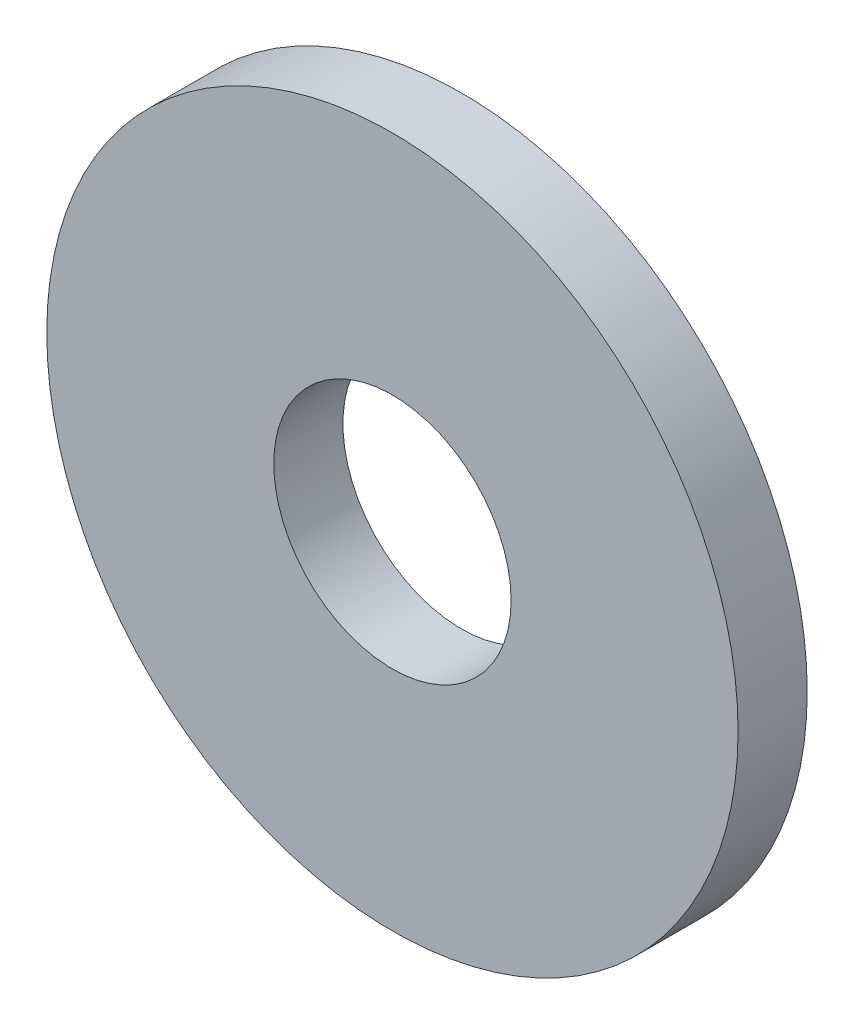
ISO-10303-21;
HEADER;
FILE_DESCRIPTION(('STEP AP214'),'2;1');
FILE_NAME('part.step','',(''),(''),'','','');
FILE_SCHEMA(('AUTOMOTIVE_DESIGN { 1 0 10303 214 1 1 1 1 }'));
ENDSEC;
DATA;
#1=APPLICATION_CONTEXT('core data for automotive mechanical design processes');
#2=APPLICATION_PROTOCOL_DEFINITION('international standard','automotive_design',2000,#1);
#3=PRODUCT_CONTEXT('',#1,'mechanical');
#4=PRODUCT('Part','Part','',(#3));
#5=PRODUCT_RELATED_PRODUCT_CATEGORY('part','',(#4));
#6=PRODUCT_DEFINITION_FORMATION('','',#4);
#7=PRODUCT_DEFINITION_CONTEXT('part definition',#1,'design');
#8=PRODUCT_DEFINITION('design','',#6,#7);
#9=PRODUCT_DEFINITION_SHAPE('','',#8);
#10=(LENGTH_UNIT() NAMED_UNIT(*) SI_UNIT(.MILLI.,.METRE.));
#11=(NAMED_UNIT(*) PLANE_ANGLE_UNIT() SI_UNIT($,.RADIAN.));
#12=(NAMED_UNIT(*) SI_UNIT($,.STERADIAN.) SOLID_ANGLE_UNIT());
#13=UNCERTAINTY_MEASURE_WITH_UNIT(LENGTH_MEASURE(1.E-05),#10,'distance_accuracy_value','');
#14=(GEOMETRIC_REPRESENTATION_CONTEXT(3) GLOBAL_UNCERTAINTY_ASSIGNED_CONTEXT((#13)) GLOBAL_UNIT_ASSIGNED_CONTEXT((#10,
#11,#12)) REPRESENTATION_CONTEXT('',''));
#15=CARTESIAN_POINT('',(0.,0.,0.));
#16=DIRECTION('',(0.,0.,1.));
#17=DIRECTION('',(1.,0.,0.));
#18=AXIS2_PLACEMENT_3D('',#15,#16,#17);
#19=CARTESIAN_POINT('',(0.,0.,1.5));
#20=DIRECTION('',(0.,0.,1.));
#21=DIRECTION('',(1.,0.,0.));
#22=AXIS2_PLACEMENT_3D('',#19,#20,#21);
#23=PLANE('',#22);
#24=CARTESIAN_POINT('',(0.,0.,1.5));
#25=DIRECTION('',(0.,0.,1.));
#26=DIRECTION('',(1.,0.,0.));
#27=AXIS2_PLACEMENT_3D('',#24,#25,#26);
#28=CIRCLE('',#27,7.5);
#29=CARTESIAN_POINT('',(7.5,0.,1.5));
#30=VERTEX_POINT('',#29);
#31=EDGE_CURVE('E9',#30,#30,#28,.T.);
#32=ORIENTED_EDGE('',*,*,#31,.T.);
#33=EDGE_LOOP('',(#32));
#34=FACE_BOUND('',#33,.T.);
#35=CARTESIAN_POINT('',(0.,0.,1.5));
#36=DIRECTION('',(0.,0.,1.));
#37=DIRECTION('',(1.,0.,0.));
#38=AXIS2_PLACEMENT_3D('',#35,#36,#37);
#39=CIRCLE('',#38,2.575);
#40=CARTESIAN_POINT('',(2.575,0.,1.5));
#41=VERTEX_POINT('',#40);
#42=EDGE_CURVE('E25',#41,#41,#39,.T.);
#43=ORIENTED_EDGE('',*,*,#42,.F.);
#44=EDGE_LOOP('',(#43));
#45=FACE_BOUND('',#44,.T.);
#46=ADVANCED_FACE('F14',(#34,#45),#23,.T.);
#47=CARTESIAN_POINT('',(0.,0.,0.));
#48=DIRECTION('',(0.,0.,1.));
#49=DIRECTION('',(1.,0.,0.));
#50=AXIS2_PLACEMENT_3D('',#47,#48,#49);
#51=PLANE('',#50);
#52=CARTESIAN_POINT('',(0.,0.,0.));
#53=DIRECTION('',(0.,0.,1.));
#54=DIRECTION('',(1.,0.,0.));
#55=AXIS2_PLACEMENT_3D('',#52,#53,#54);
#56=CIRCLE('',#55,7.5);
#57=CARTESIAN_POINT('',(7.5,0.,0.));
#58=VERTEX_POINT('',#57);
#59=EDGE_CURVE('E18',#58,#58,#56,.T.);
#60=ORIENTED_EDGE('',*,*,#59,.F.);
#61=EDGE_LOOP('',(#60));
#62=FACE_BOUND('',#61,.T.);
#63=CARTESIAN_POINT('',(0.,0.,0.));
#64=DIRECTION('',(0.,0.,1.));
#65=DIRECTION('',(1.,0.,0.));
#66=AXIS2_PLACEMENT_3D('',#63,#64,#65);
#67=CIRCLE('',#66,2.575);
#68=CARTESIAN_POINT('',(2.575,0.,0.));
#69=VERTEX_POINT('',#68);
#70=EDGE_CURVE('E27',#69,#69,#67,.T.);
#71=ORIENTED_EDGE('',*,*,#70,.T.);
#72=EDGE_LOOP('',(#71));
#73=FACE_BOUND('',#72,.T.);
#74=ADVANCED_FACE('F37',(#62,#73),#51,.F.);
#75=CARTESIAN_POINT('',(0.,0.,1.5));
#76=DIRECTION('',(0.,0.,-1.));
#77=DIRECTION('',(-1.,0.,0.));
#78=AXIS2_PLACEMENT_3D('',#75,#76,#77);
#79=CYLINDRICAL_SURFACE('',#78,7.5);
#80=ORIENTED_EDGE('',*,*,#31,.F.);
#81=EDGE_LOOP('',(#80));
#82=FACE_BOUND('',#81,.T.);
#83=ORIENTED_EDGE('',*,*,#59,.T.);
#84=EDGE_LOOP('',(#83));
#85=FACE_BOUND('',#84,.T.);
#86=ADVANCED_FACE('F16',(#82,#85),#79,.T.);
#87=CARTESIAN_POINT('',(0.,0.,1.5));
#88=DIRECTION('',(0.,0.,-1.));
#89=DIRECTION('',(-1.,0.,0.));
#90=AXIS2_PLACEMENT_3D('',#87,#88,#89);
#91=CYLINDRICAL_SURFACE('',#90,2.575);
#92=ORIENTED_EDGE('',*,*,#42,.T.);
#93=EDGE_LOOP('',(#92));
#94=FACE_BOUND('',#93,.T.);
#95=ORIENTED_EDGE('',*,*,#70,.F.);
#96=EDGE_LOOP('',(#95));
#97=FACE_BOUND('',#96,.T.);
#98=ADVANCED_FACE('F33',(#94,#97),#91,.F.);
#99=CLOSED_SHELL('',(#46,#74,#86,#98));
#100=MANIFOLD_SOLID_BREP('B1',#99);
#101=ADVANCED_BREP_SHAPE_REPRESENTATION('',(#18,#100),#14);
#102=SHAPE_DEFINITION_REPRESENTATION(#9,#101);
ENDSEC;
END-ISO-10303-21;
